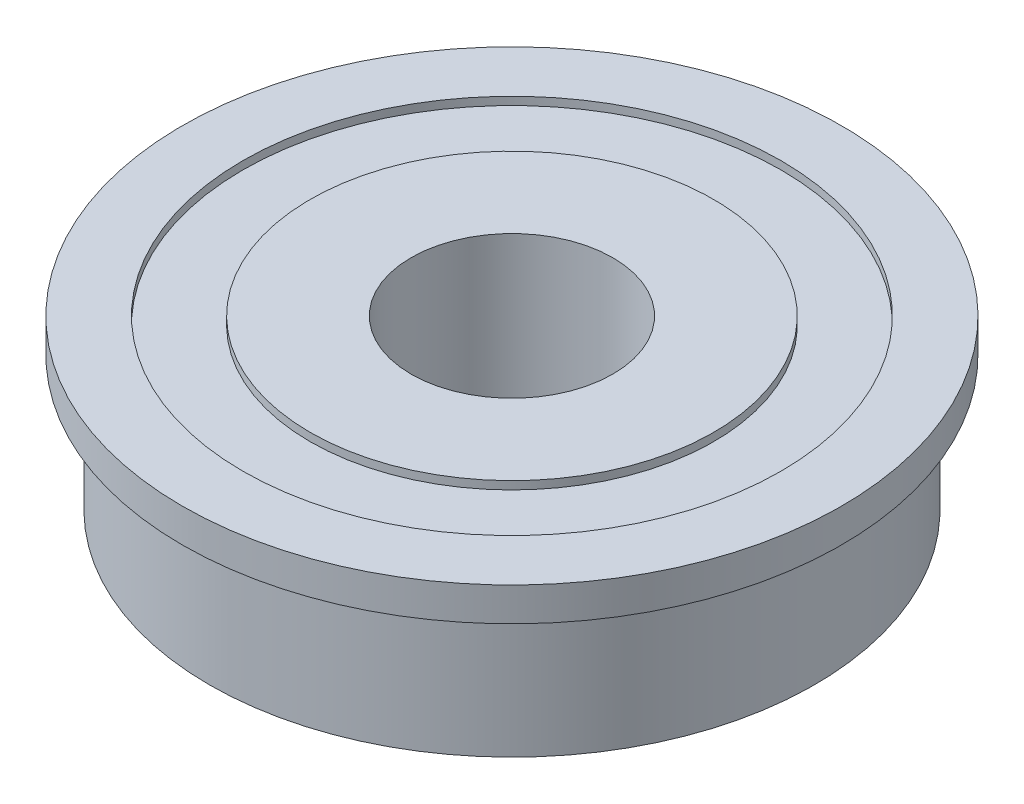
ISO-10303-21;
HEADER;
FILE_DESCRIPTION(('STEP AP214'),'2;1');
FILE_NAME('part.step','',(''),(''),'','','');
FILE_SCHEMA(('AUTOMOTIVE_DESIGN { 1 0 10303 214 1 1 1 1 }'));
ENDSEC;
DATA;
#1=APPLICATION_CONTEXT('core data for automotive mechanical design processes');
#2=APPLICATION_PROTOCOL_DEFINITION('international standard','automotive_design',2000,#1);
#3=PRODUCT_CONTEXT('',#1,'mechanical');
#4=PRODUCT('Part','Part','',(#3));
#5=PRODUCT_RELATED_PRODUCT_CATEGORY('part','',(#4));
#6=PRODUCT_DEFINITION_FORMATION('','',#4);
#7=PRODUCT_DEFINITION_CONTEXT('part definition',#1,'design');
#8=PRODUCT_DEFINITION('design','',#6,#7);
#9=PRODUCT_DEFINITION_SHAPE('','',#8);
#10=(LENGTH_UNIT() NAMED_UNIT(*) SI_UNIT(.MILLI.,.METRE.));
#11=(NAMED_UNIT(*) PLANE_ANGLE_UNIT() SI_UNIT($,.RADIAN.));
#12=(NAMED_UNIT(*) SI_UNIT($,.STERADIAN.) SOLID_ANGLE_UNIT());
#13=UNCERTAINTY_MEASURE_WITH_UNIT(LENGTH_MEASURE(1.E-05),#10,'distance_accuracy_value','');
#14=(GEOMETRIC_REPRESENTATION_CONTEXT(3) GLOBAL_UNCERTAINTY_ASSIGNED_CONTEXT((#13)) GLOBAL_UNIT_ASSIGNED_CONTEXT((#10,
#11,#12)) REPRESENTATION_CONTEXT('',''));
#15=CARTESIAN_POINT('',(0.,0.,0.));
#16=DIRECTION('',(0.,0.,1.));
#17=DIRECTION('',(1.,0.,0.));
#18=AXIS2_PLACEMENT_3D('',#15,#16,#17);
#19=CARTESIAN_POINT('',(0.,0.,0.));
#20=DIRECTION('',(0.,1.,0.));
#21=DIRECTION('',(0.,0.,1.));
#22=AXIS2_PLACEMENT_3D('',#19,#20,#21);
#23=CYLINDRICAL_SURFACE('',#22,12.7);
#24=CARTESIAN_POINT('',(0.,7.9375,0.));
#25=DIRECTION('',(0.,1.,0.));
#26=DIRECTION('',(0.,0.,1.));
#27=AXIS2_PLACEMENT_3D('',#24,#25,#26);
#28=CIRCLE('',#27,12.7);
#29=CARTESIAN_POINT('',(0.,7.9375,12.7));
#30=VERTEX_POINT('',#29);
#31=EDGE_CURVE('E46',#30,#30,#28,.F.);
#32=ORIENTED_EDGE('',*,*,#31,.F.);
#33=EDGE_LOOP('',(#32));
#34=FACE_BOUND('',#33,.T.);
#35=CARTESIAN_POINT('',(0.,7.5565,0.));
#36=DIRECTION('',(0.,1.,0.));
#37=DIRECTION('',(0.,0.,1.));
#38=AXIS2_PLACEMENT_3D('',#35,#36,#37);
#39=CIRCLE('',#38,12.7);
#40=CARTESIAN_POINT('',(0.,7.5565,12.7));
#41=VERTEX_POINT('',#40);
#42=EDGE_CURVE('E18',#41,#41,#39,.T.);
#43=ORIENTED_EDGE('',*,*,#42,.F.);
#44=EDGE_LOOP('',(#43));
#45=FACE_BOUND('',#44,.T.);
#46=ADVANCED_FACE('F15',(#34,#45),#23,.F.);
#47=CARTESIAN_POINT('',(9.525,7.5565,0.));
#48=DIRECTION('',(0.,1.,0.));
#49=DIRECTION('',(0.,0.,1.));
#50=AXIS2_PLACEMENT_3D('',#47,#48,#49);
#51=PLANE('',#50);
#52=CARTESIAN_POINT('',(0.,7.5565,0.));
#53=DIRECTION('',(0.,1.,0.));
#54=DIRECTION('',(0.,0.,1.));
#55=AXIS2_PLACEMENT_3D('',#52,#53,#54);
#56=CIRCLE('',#55,9.525);
#57=CARTESIAN_POINT('',(0.,7.5565,9.525));
#58=VERTEX_POINT('',#57);
#59=EDGE_CURVE('E44',#58,#58,#56,.T.);
#60=ORIENTED_EDGE('',*,*,#59,.F.);
#61=EDGE_LOOP('',(#60));
#62=FACE_BOUND('',#61,.T.);
#63=ORIENTED_EDGE('',*,*,#42,.T.);
#64=EDGE_LOOP('',(#63));
#65=FACE_BOUND('',#64,.T.);
#66=ADVANCED_FACE('F53',(#62,#65),#51,.T.);
#67=CARTESIAN_POINT('',(12.7,7.9375,0.));
#68=DIRECTION('',(0.,1.,0.));
#69=DIRECTION('',(0.,0.,1.));
#70=AXIS2_PLACEMENT_3D('',#67,#68,#69);
#71=PLANE('',#70);
#72=ORIENTED_EDGE('',*,*,#31,.T.);
#73=EDGE_LOOP('',(#72));
#74=FACE_BOUND('',#73,.T.);
#75=CARTESIAN_POINT('',(0.,7.9375,0.));
#76=DIRECTION('',(0.,1.,0.));
#77=DIRECTION('',(0.,0.,1.));
#78=AXIS2_PLACEMENT_3D('',#75,#76,#77);
#79=CIRCLE('',#78,15.5575);
#80=CARTESIAN_POINT('',(0.,7.9375,15.5575));
#81=VERTEX_POINT('',#80);
#82=EDGE_CURVE('E41',#81,#81,#79,.F.);
#83=ORIENTED_EDGE('',*,*,#82,.F.);
#84=EDGE_LOOP('',(#83));
#85=FACE_BOUND('',#84,.T.);
#86=ADVANCED_FACE('F60',(#74,#85),#71,.T.);
#87=CARTESIAN_POINT('',(0.,0.,0.));
#88=DIRECTION('',(0.,1.,0.));
#89=DIRECTION('',(0.,0.,1.));
#90=AXIS2_PLACEMENT_3D('',#87,#88,#89);
#91=CYLINDRICAL_SURFACE('',#90,9.525);
#92=ORIENTED_EDGE('',*,*,#59,.T.);
#93=EDGE_LOOP('',(#92));
#94=FACE_BOUND('',#93,.T.);
#95=CARTESIAN_POINT('',(0.,7.9375,0.));
#96=DIRECTION('',(0.,1.,0.));
#97=DIRECTION('',(0.,0.,1.));
#98=AXIS2_PLACEMENT_3D('',#95,#96,#97);
#99=CIRCLE('',#98,9.525);
#100=CARTESIAN_POINT('',(0.,7.9375,9.525));
#101=VERTEX_POINT('',#100);
#102=EDGE_CURVE('E38',#101,#101,#99,.T.);
#103=ORIENTED_EDGE('',*,*,#102,.F.);
#104=EDGE_LOOP('',(#103));
#105=FACE_BOUND('',#104,.T.);
#106=ADVANCED_FACE('F88',(#94,#105),#91,.T.);
#107=CARTESIAN_POINT('',(0.,0.,0.));
#108=DIRECTION('',(0.,1.,0.));
#109=DIRECTION('',(0.,0.,1.));
#110=AXIS2_PLACEMENT_3D('',#107,#108,#109);
#111=CYLINDRICAL_SURFACE('',#110,15.5575);
#112=CARTESIAN_POINT('',(0.,6.35,0.));
#113=DIRECTION('',(0.,1.,0.));
#114=DIRECTION('',(0.,0.,1.));
#115=AXIS2_PLACEMENT_3D('',#112,#113,#114);
#116=CIRCLE('',#115,15.5575);
#117=CARTESIAN_POINT('',(0.,6.35,15.5575));
#118=VERTEX_POINT('',#117);
#119=EDGE_CURVE('E35',#118,#118,#116,.F.);
#120=ORIENTED_EDGE('',*,*,#119,.F.);
#121=EDGE_LOOP('',(#120));
#122=FACE_BOUND('',#121,.T.);
#123=ORIENTED_EDGE('',*,*,#82,.T.);
#124=EDGE_LOOP('',(#123));
#125=FACE_BOUND('',#124,.T.);
#126=ADVANCED_FACE('F84',(#122,#125),#111,.T.);
#127=CARTESIAN_POINT('',(4.7625,7.9375,0.));
#128=DIRECTION('',(0.,1.,0.));
#129=DIRECTION('',(0.,0.,1.));
#130=AXIS2_PLACEMENT_3D('',#127,#128,#129);
#131=PLANE('',#130);
#132=CARTESIAN_POINT('',(0.,7.9375,0.));
#133=DIRECTION('',(0.,1.,0.));
#134=DIRECTION('',(0.,0.,1.));
#135=AXIS2_PLACEMENT_3D('',#132,#133,#134);
#136=CIRCLE('',#135,4.7625);
#137=CARTESIAN_POINT('',(0.,7.9375,4.7625));
#138=VERTEX_POINT('',#137);
#139=EDGE_CURVE('E32',#138,#138,#136,.F.);
#140=ORIENTED_EDGE('',*,*,#139,.T.);
#141=EDGE_LOOP('',(#140));
#142=FACE_BOUND('',#141,.T.);
#143=ORIENTED_EDGE('',*,*,#102,.T.);
#144=EDGE_LOOP('',(#143));
#145=FACE_BOUND('',#144,.T.);
#146=ADVANCED_FACE('F80',(#142,#145),#131,.T.);
#147=CARTESIAN_POINT('',(15.5575,6.35,0.));
#148=DIRECTION('',(0.,-1.,0.));
#149=DIRECTION('',(0.,0.,-1.));
#150=AXIS2_PLACEMENT_3D('',#147,#148,#149);
#151=PLANE('',#150);
#152=ORIENTED_EDGE('',*,*,#119,.T.);
#153=EDGE_LOOP('',(#152));
#154=FACE_BOUND('',#153,.T.);
#155=CARTESIAN_POINT('',(0.,6.35,0.));
#156=DIRECTION('',(0.,1.,0.));
#157=DIRECTION('',(0.,0.,1.));
#158=AXIS2_PLACEMENT_3D('',#155,#156,#157);
#159=CIRCLE('',#158,14.2875);
#160=CARTESIAN_POINT('',(0.,6.35,14.2875));
#161=VERTEX_POINT('',#160);
#162=EDGE_CURVE('E27',#161,#161,#159,.F.);
#163=ORIENTED_EDGE('',*,*,#162,.F.);
#164=EDGE_LOOP('',(#163));
#165=FACE_BOUND('',#164,.T.);
#166=ADVANCED_FACE('F76',(#154,#165),#151,.T.);
#167=CARTESIAN_POINT('',(0.,0.,0.));
#168=DIRECTION('',(0.,1.,0.));
#169=DIRECTION('',(0.,0.,1.));
#170=AXIS2_PLACEMENT_3D('',#167,#168,#169);
#171=CYLINDRICAL_SURFACE('',#170,4.7625);
#172=ORIENTED_EDGE('',*,*,#139,.F.);
#173=EDGE_LOOP('',(#172));
#174=FACE_BOUND('',#173,.T.);
#175=CARTESIAN_POINT('',(0.,0.,0.));
#176=DIRECTION('',(0.,1.,0.));
#177=DIRECTION('',(0.,0.,1.));
#178=AXIS2_PLACEMENT_3D('',#175,#176,#177);
#179=CIRCLE('',#178,4.7625);
#180=CARTESIAN_POINT('',(0.,0.,4.7625));
#181=VERTEX_POINT('',#180);
#182=EDGE_CURVE('E22',#181,#181,#179,.T.);
#183=ORIENTED_EDGE('',*,*,#182,.F.);
#184=EDGE_LOOP('',(#183));
#185=FACE_BOUND('',#184,.T.);
#186=ADVANCED_FACE('F69',(#174,#185),#171,.F.);
#187=CARTESIAN_POINT('',(0.,0.,0.));
#188=DIRECTION('',(0.,1.,0.));
#189=DIRECTION('',(0.,0.,1.));
#190=AXIS2_PLACEMENT_3D('',#187,#188,#189);
#191=CYLINDRICAL_SURFACE('',#190,14.2875);
#192=CARTESIAN_POINT('',(0.,0.,0.));
#193=DIRECTION('',(0.,1.,0.));
#194=DIRECTION('',(0.,0.,1.));
#195=AXIS2_PLACEMENT_3D('',#192,#193,#194);
#196=CIRCLE('',#195,14.2875);
#197=CARTESIAN_POINT('',(0.,0.,14.2875));
#198=VERTEX_POINT('',#197);
#199=EDGE_CURVE('E9',#198,#198,#196,.F.);
#200=ORIENTED_EDGE('',*,*,#199,.F.);
#201=EDGE_LOOP('',(#200));
#202=FACE_BOUND('',#201,.T.);
#203=ORIENTED_EDGE('',*,*,#162,.T.);
#204=EDGE_LOOP('',(#203));
#205=FACE_BOUND('',#204,.T.);
#206=ADVANCED_FACE('F64',(#202,#205),#191,.T.);
#207=CARTESIAN_POINT('',(14.2875,0.,0.));
#208=DIRECTION('',(0.,-1.,0.));
#209=DIRECTION('',(0.,0.,-1.));
#210=AXIS2_PLACEMENT_3D('',#207,#208,#209);
#211=PLANE('',#210);
#212=ORIENTED_EDGE('',*,*,#199,.T.);
#213=EDGE_LOOP('',(#212));
#214=FACE_BOUND('',#213,.T.);
#215=ORIENTED_EDGE('',*,*,#182,.T.);
#216=EDGE_LOOP('',(#215));
#217=FACE_BOUND('',#216,.T.);
#218=ADVANCED_FACE('F62',(#214,#217),#211,.T.);
#219=CLOSED_SHELL('',(#46,#66,#86,#106,#126,#146,#166,#186,#206,#218));
#220=MANIFOLD_SOLID_BREP('B1',#219);
#221=ADVANCED_BREP_SHAPE_REPRESENTATION('',(#18,#220),#14);
#222=SHAPE_DEFINITION_REPRESENTATION(#9,#221);
ENDSEC;
END-ISO-10303-21;
